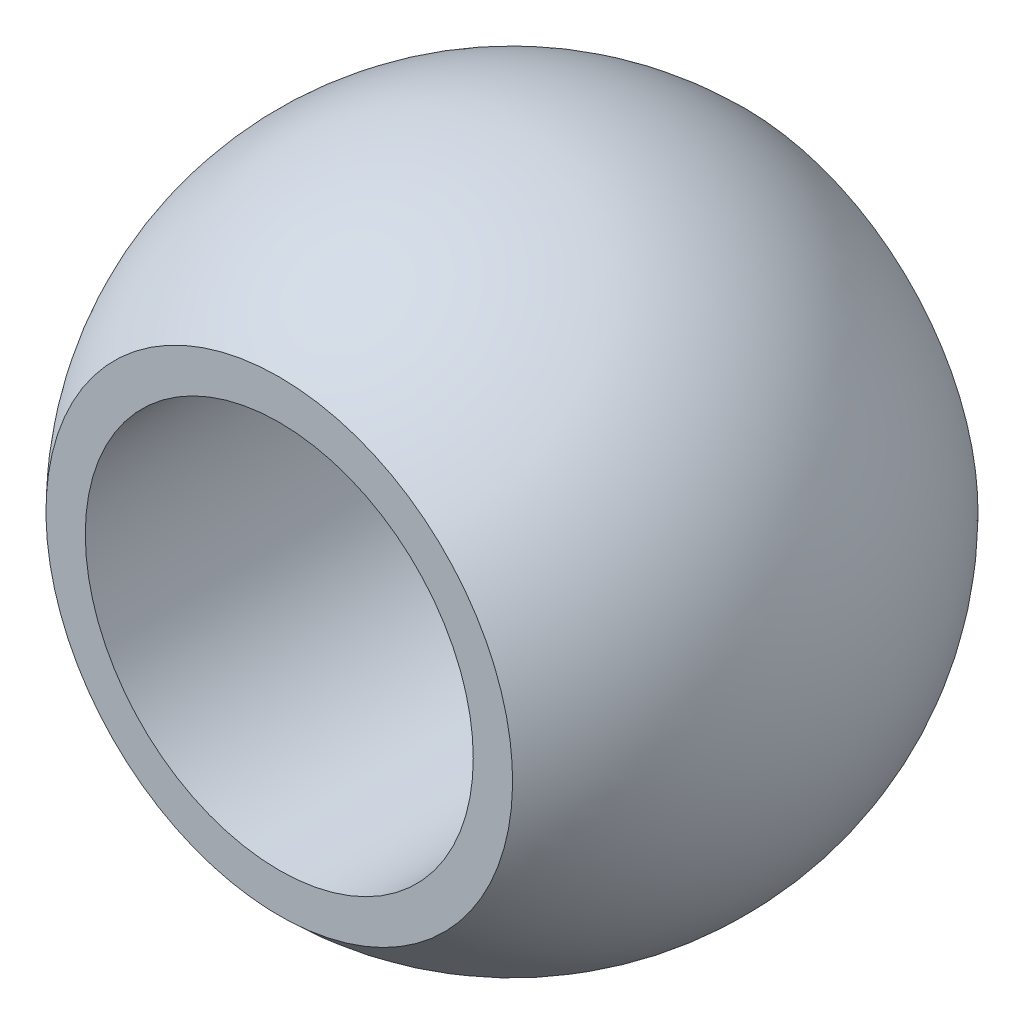
ISO-10303-21;
HEADER;
FILE_DESCRIPTION(('STEP AP214'),'2;1');
FILE_NAME('part.step','',(''),(''),'','','');
FILE_SCHEMA(('AUTOMOTIVE_DESIGN { 1 0 10303 214 1 1 1 1 }'));
ENDSEC;
DATA;
#1=APPLICATION_CONTEXT('core data for automotive mechanical design processes');
#2=APPLICATION_PROTOCOL_DEFINITION('international standard','automotive_design',2000,#1);
#3=PRODUCT_CONTEXT('',#1,'mechanical');
#4=PRODUCT('Part','Part','',(#3));
#5=PRODUCT_RELATED_PRODUCT_CATEGORY('part','',(#4));
#6=PRODUCT_DEFINITION_FORMATION('','',#4);
#7=PRODUCT_DEFINITION_CONTEXT('part definition',#1,'design');
#8=PRODUCT_DEFINITION('design','',#6,#7);
#9=PRODUCT_DEFINITION_SHAPE('','',#8);
#10=(LENGTH_UNIT() NAMED_UNIT(*) SI_UNIT(.MILLI.,.METRE.));
#11=(NAMED_UNIT(*) PLANE_ANGLE_UNIT() SI_UNIT($,.RADIAN.));
#12=(NAMED_UNIT(*) SI_UNIT($,.STERADIAN.) SOLID_ANGLE_UNIT());
#13=UNCERTAINTY_MEASURE_WITH_UNIT(LENGTH_MEASURE(1.E-05),#10,'distance_accuracy_value','');
#14=(GEOMETRIC_REPRESENTATION_CONTEXT(3) GLOBAL_UNCERTAINTY_ASSIGNED_CONTEXT((#13)) GLOBAL_UNIT_ASSIGNED_CONTEXT((#10,
#11,#12)) REPRESENTATION_CONTEXT('',''));
#15=CARTESIAN_POINT('',(0.,0.,0.));
#16=DIRECTION('',(0.,0.,1.));
#17=DIRECTION('',(1.,0.,0.));
#18=AXIS2_PLACEMENT_3D('',#15,#16,#17);
#19=CARTESIAN_POINT('',(0.,7.94,-9.525));
#20=DIRECTION('',(0.,0.,-1.));
#21=DIRECTION('',(0.,1.,0.));
#22=AXIS2_PLACEMENT_3D('',#19,#20,#21);
#23=PLANE('',#22);
#24=CARTESIAN_POINT('',(0.,0.,-9.525));
#25=DIRECTION('',(0.,0.,-1.));
#26=DIRECTION('',(0.,1.,0.));
#27=AXIS2_PLACEMENT_3D('',#24,#25,#26);
#28=CIRCLE('',#27,9.5490488405914);
#29=CARTESIAN_POINT('',(0.,9.5490488405914,-9.525));
#30=VERTEX_POINT('',#29);
#31=EDGE_CURVE('E10',#30,#30,#28,.T.);
#32=ORIENTED_EDGE('',*,*,#31,.T.);
#33=EDGE_LOOP('',(#32));
#34=FACE_BOUND('',#33,.T.);
#35=CARTESIAN_POINT('',(0.,0.,-9.525));
#36=DIRECTION('',(0.,0.,-1.));
#37=DIRECTION('',(0.,1.,0.));
#38=AXIS2_PLACEMENT_3D('',#35,#36,#37);
#39=CIRCLE('',#38,7.94);
#40=CARTESIAN_POINT('',(0.,7.94,-9.525));
#41=VERTEX_POINT('',#40);
#42=EDGE_CURVE('E47',#41,#41,#39,.T.);
#43=ORIENTED_EDGE('',*,*,#42,.F.);
#44=EDGE_LOOP('',(#43));
#45=FACE_BOUND('',#44,.T.);
#46=ADVANCED_FACE('F33',(#34,#45),#23,.T.);
#47=CARTESIAN_POINT('',(0.,0.,0.));
#48=DIRECTION('',(0.,0.,-1.));
#49=DIRECTION('',(0.,1.,0.));
#50=AXIS2_PLACEMENT_3D('',#47,#48,#49);
#51=SPHERICAL_SURFACE('',#50,13.4874);
#52=CARTESIAN_POINT('',(0.,0.,9.525));
#53=DIRECTION('',(0.,0.,-1.));
#54=DIRECTION('',(0.,1.,0.));
#55=AXIS2_PLACEMENT_3D('',#52,#53,#54);
#56=CIRCLE('',#55,9.5490488405914);
#57=CARTESIAN_POINT('',(0.,9.5490488405914,9.525));
#58=VERTEX_POINT('',#57);
#59=EDGE_CURVE('E39',#58,#58,#56,.T.);
#60=ORIENTED_EDGE('',*,*,#59,.T.);
#61=EDGE_LOOP('',(#60));
#62=FACE_BOUND('',#61,.T.);
#63=ORIENTED_EDGE('',*,*,#31,.F.);
#64=EDGE_LOOP('',(#63));
#65=FACE_BOUND('',#64,.T.);
#66=ADVANCED_FACE('F57',(#62,#65),#51,.T.);
#67=CARTESIAN_POINT('',(0.,7.94,9.525));
#68=DIRECTION('',(0.,0.,1.));
#69=DIRECTION('',(0.,-1.,0.));
#70=AXIS2_PLACEMENT_3D('',#67,#68,#69);
#71=PLANE('',#70);
#72=CARTESIAN_POINT('',(0.,0.,9.525));
#73=DIRECTION('',(0.,0.,-1.));
#74=DIRECTION('',(0.,1.,0.));
#75=AXIS2_PLACEMENT_3D('',#72,#73,#74);
#76=CIRCLE('',#75,7.94);
#77=CARTESIAN_POINT('',(0.,7.94,9.525));
#78=VERTEX_POINT('',#77);
#79=EDGE_CURVE('E43',#78,#78,#76,.T.);
#80=ORIENTED_EDGE('',*,*,#79,.T.);
#81=EDGE_LOOP('',(#80));
#82=FACE_BOUND('',#81,.T.);
#83=ORIENTED_EDGE('',*,*,#59,.F.);
#84=EDGE_LOOP('',(#83));
#85=FACE_BOUND('',#84,.T.);
#86=ADVANCED_FACE('F61',(#82,#85),#71,.T.);
#87=CARTESIAN_POINT('',(0.,0.,-9.89143216947371));
#88=DIRECTION('',(0.,0.,-1.));
#89=DIRECTION('',(0.,1.,0.));
#90=AXIS2_PLACEMENT_3D('',#87,#88,#89);
#91=CYLINDRICAL_SURFACE('',#90,7.94);
#92=ORIENTED_EDGE('',*,*,#42,.T.);
#93=EDGE_LOOP('',(#92));
#94=FACE_BOUND('',#93,.T.);
#95=ORIENTED_EDGE('',*,*,#79,.F.);
#96=EDGE_LOOP('',(#95));
#97=FACE_BOUND('',#96,.T.);
#98=ADVANCED_FACE('F53',(#94,#97),#91,.F.);
#99=CLOSED_SHELL('',(#46,#66,#86,#98));
#100=MANIFOLD_SOLID_BREP('B2',#99);
#101=ADVANCED_BREP_SHAPE_REPRESENTATION('',(#18,#100),#14);
#102=SHAPE_DEFINITION_REPRESENTATION(#9,#101);
ENDSEC;
END-ISO-10303-21;
